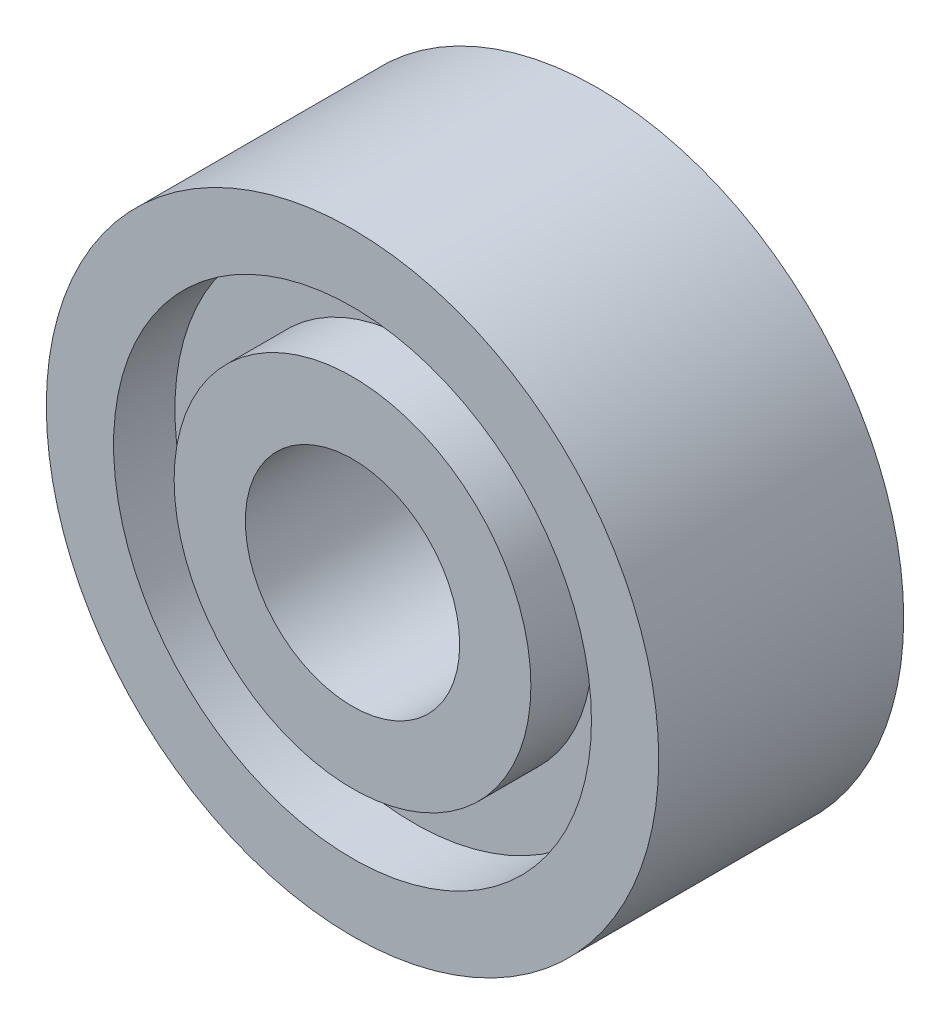
ISO-10303-21;
HEADER;
FILE_DESCRIPTION(('STEP AP214'),'2;1');
FILE_NAME('part.step','',(''),(''),'','','');
FILE_SCHEMA(('AUTOMOTIVE_DESIGN { 1 0 10303 214 1 1 1 1 }'));
ENDSEC;
DATA;
#1=APPLICATION_CONTEXT('core data for automotive mechanical design processes');
#2=APPLICATION_PROTOCOL_DEFINITION('international standard','automotive_design',2000,#1);
#3=PRODUCT_CONTEXT('',#1,'mechanical');
#4=PRODUCT('Part','Part','',(#3));
#5=PRODUCT_RELATED_PRODUCT_CATEGORY('part','',(#4));
#6=PRODUCT_DEFINITION_FORMATION('','',#4);
#7=PRODUCT_DEFINITION_CONTEXT('part definition',#1,'design');
#8=PRODUCT_DEFINITION('design','',#6,#7);
#9=PRODUCT_DEFINITION_SHAPE('','',#8);
#10=(LENGTH_UNIT() NAMED_UNIT(*) SI_UNIT(.MILLI.,.METRE.));
#11=(NAMED_UNIT(*) PLANE_ANGLE_UNIT() SI_UNIT($,.RADIAN.));
#12=(NAMED_UNIT(*) SI_UNIT($,.STERADIAN.) SOLID_ANGLE_UNIT());
#13=UNCERTAINTY_MEASURE_WITH_UNIT(LENGTH_MEASURE(1.E-05),#10,'distance_accuracy_value','');
#14=(GEOMETRIC_REPRESENTATION_CONTEXT(3) GLOBAL_UNCERTAINTY_ASSIGNED_CONTEXT((#13)) GLOBAL_UNIT_ASSIGNED_CONTEXT((#10,
#11,#12)) REPRESENTATION_CONTEXT('',''));
#15=CARTESIAN_POINT('',(0.,0.,0.));
#16=DIRECTION('',(0.,0.,1.));
#17=DIRECTION('',(1.,0.,0.));
#18=AXIS2_PLACEMENT_3D('',#15,#16,#17);
#19=CARTESIAN_POINT('',(0.,7.80314821028766,0.));
#20=DIRECTION('',(0.,0.,-1.));
#21=DIRECTION('',(-1.,0.,0.));
#22=AXIS2_PLACEMENT_3D('',#19,#20,#21);
#23=PLANE('',#22);
#24=CARTESIAN_POINT('',(0.,0.,0.));
#25=DIRECTION('',(0.,0.,1.));
#26=DIRECTION('',(1.,0.,0.));
#27=AXIS2_PLACEMENT_3D('',#24,#25,#26);
#28=CIRCLE('',#27,7.80314821028766);
#29=CARTESIAN_POINT('',(7.80314821028766,0.,0.));
#30=VERTEX_POINT('',#29);
#31=EDGE_CURVE('E88',#30,#30,#28,.T.);
#32=ORIENTED_EDGE('',*,*,#31,.F.);
#33=EDGE_LOOP('',(#32));
#34=FACE_BOUND('',#33,.T.);
#35=CARTESIAN_POINT('',(0.,0.,0.));
#36=DIRECTION('',(0.,0.,1.));
#37=DIRECTION('',(1.,0.,0.));
#38=AXIS2_PLACEMENT_3D('',#35,#36,#37);
#39=CIRCLE('',#38,10.);
#40=CARTESIAN_POINT('',(10.,0.,0.));
#41=VERTEX_POINT('',#40);
#42=EDGE_CURVE('E10',#41,#41,#39,.T.);
#43=ORIENTED_EDGE('',*,*,#42,.T.);
#44=EDGE_LOOP('',(#43));
#45=FACE_BOUND('',#44,.T.);
#46=ADVANCED_FACE('F37',(#34,#45),#23,.F.);
#47=CARTESIAN_POINT('',(0.,0.,23.3142857142857));
#48=DIRECTION('',(0.,0.,1.));
#49=DIRECTION('',(1.,0.,0.));
#50=AXIS2_PLACEMENT_3D('',#47,#48,#49);
#51=CYLINDRICAL_SURFACE('',#50,10.);
#52=ORIENTED_EDGE('',*,*,#42,.F.);
#53=EDGE_LOOP('',(#52));
#54=FACE_BOUND('',#53,.T.);
#55=CARTESIAN_POINT('',(0.,0.,-8.));
#56=DIRECTION('',(0.,0.,1.));
#57=DIRECTION('',(1.,0.,0.));
#58=AXIS2_PLACEMENT_3D('',#55,#56,#57);
#59=CIRCLE('',#58,10.);
#60=CARTESIAN_POINT('',(10.,0.,-8.));
#61=VERTEX_POINT('',#60);
#62=EDGE_CURVE('E44',#61,#61,#59,.T.);
#63=ORIENTED_EDGE('',*,*,#62,.T.);
#64=EDGE_LOOP('',(#63));
#65=FACE_BOUND('',#64,.T.);
#66=ADVANCED_FACE('F96',(#54,#65),#51,.T.);
#67=CARTESIAN_POINT('',(0.,10.,-8.));
#68=DIRECTION('',(0.,0.,1.));
#69=DIRECTION('',(1.,0.,0.));
#70=AXIS2_PLACEMENT_3D('',#67,#68,#69);
#71=PLANE('',#70);
#72=ORIENTED_EDGE('',*,*,#62,.F.);
#73=EDGE_LOOP('',(#72));
#74=FACE_BOUND('',#73,.T.);
#75=CARTESIAN_POINT('',(0.,0.,-8.));
#76=DIRECTION('',(0.,0.,1.));
#77=DIRECTION('',(1.,0.,0.));
#78=AXIS2_PLACEMENT_3D('',#75,#76,#77);
#79=CIRCLE('',#78,7.80314821028767);
#80=CARTESIAN_POINT('',(7.80314821028767,0.,-8.));
#81=VERTEX_POINT('',#80);
#82=EDGE_CURVE('E49',#81,#81,#79,.T.);
#83=ORIENTED_EDGE('',*,*,#82,.T.);
#84=EDGE_LOOP('',(#83));
#85=FACE_BOUND('',#84,.T.);
#86=ADVANCED_FACE('F100',(#74,#85),#71,.F.);
#87=CARTESIAN_POINT('',(0.,0.,23.3142857142857));
#88=DIRECTION('',(0.,0.,1.));
#89=DIRECTION('',(1.,0.,0.));
#90=AXIS2_PLACEMENT_3D('',#87,#88,#89);
#91=CYLINDRICAL_SURFACE('',#90,7.80314821028767);
#92=ORIENTED_EDGE('',*,*,#82,.F.);
#93=EDGE_LOOP('',(#92));
#94=FACE_BOUND('',#93,.T.);
#95=CARTESIAN_POINT('',(0.,0.,-6.43237181267207));
#96=DIRECTION('',(0.,0.,1.));
#97=DIRECTION('',(1.,0.,0.));
#98=AXIS2_PLACEMENT_3D('',#95,#96,#97);
#99=CIRCLE('',#98,7.80314821028767);
#100=CARTESIAN_POINT('',(7.80314821028767,0.,-6.43237181267207));
#101=VERTEX_POINT('',#100);
#102=EDGE_CURVE('E54',#101,#101,#99,.T.);
#103=ORIENTED_EDGE('',*,*,#102,.T.);
#104=EDGE_LOOP('',(#103));
#105=FACE_BOUND('',#104,.T.);
#106=ADVANCED_FACE('F105',(#94,#105),#91,.F.);
#107=CARTESIAN_POINT('',(0.,7.80314821028767,-6.43237181267207));
#108=DIRECTION('',(0.,0.,1.));
#109=DIRECTION('',(1.,0.,0.));
#110=AXIS2_PLACEMENT_3D('',#107,#108,#109);
#111=PLANE('',#110);
#112=ORIENTED_EDGE('',*,*,#102,.F.);
#113=EDGE_LOOP('',(#112));
#114=FACE_BOUND('',#113,.T.);
#115=CARTESIAN_POINT('',(0.,0.,-6.43237181267207));
#116=DIRECTION('',(0.,0.,1.));
#117=DIRECTION('',(1.,0.,0.));
#118=AXIS2_PLACEMENT_3D('',#115,#116,#117);
#119=CIRCLE('',#118,5.82541417828377);
#120=CARTESIAN_POINT('',(5.82541417828377,0.,-6.43237181267207));
#121=VERTEX_POINT('',#120);
#122=EDGE_CURVE('E60',#121,#121,#119,.T.);
#123=ORIENTED_EDGE('',*,*,#122,.T.);
#124=EDGE_LOOP('',(#123));
#125=FACE_BOUND('',#124,.T.);
#126=ADVANCED_FACE('F111',(#114,#125),#111,.F.);
#127=CARTESIAN_POINT('',(0.,0.,23.3142857142857));
#128=DIRECTION('',(0.,0.,1.));
#129=DIRECTION('',(1.,0.,0.));
#130=AXIS2_PLACEMENT_3D('',#127,#128,#129);
#131=CYLINDRICAL_SURFACE('',#130,5.82541417828377);
#132=ORIENTED_EDGE('',*,*,#122,.F.);
#133=EDGE_LOOP('',(#132));
#134=FACE_BOUND('',#133,.T.);
#135=CARTESIAN_POINT('',(0.,0.,-8.));
#136=DIRECTION('',(0.,0.,1.));
#137=DIRECTION('',(1.,0.,0.));
#138=AXIS2_PLACEMENT_3D('',#135,#136,#137);
#139=CIRCLE('',#138,5.82541417828377);
#140=CARTESIAN_POINT('',(5.82541417828377,0.,-8.));
#141=VERTEX_POINT('',#140);
#142=EDGE_CURVE('E64',#141,#141,#139,.T.);
#143=ORIENTED_EDGE('',*,*,#142,.T.);
#144=EDGE_LOOP('',(#143));
#145=FACE_BOUND('',#144,.T.);
#146=ADVANCED_FACE('F115',(#134,#145),#131,.T.);
#147=CARTESIAN_POINT('',(0.,5.82541417828377,-8.));
#148=DIRECTION('',(0.,0.,1.));
#149=DIRECTION('',(1.,0.,0.));
#150=AXIS2_PLACEMENT_3D('',#147,#148,#149);
#151=PLANE('',#150);
#152=ORIENTED_EDGE('',*,*,#142,.F.);
#153=EDGE_LOOP('',(#152));
#154=FACE_BOUND('',#153,.T.);
#155=CARTESIAN_POINT('',(0.,0.,-8.));
#156=DIRECTION('',(0.,0.,1.));
#157=DIRECTION('',(1.,0.,0.));
#158=AXIS2_PLACEMENT_3D('',#155,#156,#157);
#159=CIRCLE('',#158,3.5);
#160=CARTESIAN_POINT('',(3.5,0.,-8.));
#161=VERTEX_POINT('',#160);
#162=EDGE_CURVE('E68',#161,#161,#159,.T.);
#163=ORIENTED_EDGE('',*,*,#162,.T.);
#164=EDGE_LOOP('',(#163));
#165=FACE_BOUND('',#164,.T.);
#166=ADVANCED_FACE('F119',(#154,#165),#151,.F.);
#167=CARTESIAN_POINT('',(0.,0.,23.3142857142857));
#168=DIRECTION('',(0.,0.,1.));
#169=DIRECTION('',(1.,0.,0.));
#170=AXIS2_PLACEMENT_3D('',#167,#168,#169);
#171=CYLINDRICAL_SURFACE('',#170,3.5);
#172=ORIENTED_EDGE('',*,*,#162,.F.);
#173=EDGE_LOOP('',(#172));
#174=FACE_BOUND('',#173,.T.);
#175=CARTESIAN_POINT('',(0.,0.,0.));
#176=DIRECTION('',(0.,0.,1.));
#177=DIRECTION('',(1.,0.,0.));
#178=AXIS2_PLACEMENT_3D('',#175,#176,#177);
#179=CIRCLE('',#178,3.5);
#180=CARTESIAN_POINT('',(3.5,0.,0.));
#181=VERTEX_POINT('',#180);
#182=EDGE_CURVE('E72',#181,#181,#179,.T.);
#183=ORIENTED_EDGE('',*,*,#182,.T.);
#184=EDGE_LOOP('',(#183));
#185=FACE_BOUND('',#184,.T.);
#186=ADVANCED_FACE('F123',(#174,#185),#171,.F.);
#187=CARTESIAN_POINT('',(0.,3.5,0.));
#188=DIRECTION('',(0.,0.,-1.));
#189=DIRECTION('',(-1.,0.,0.));
#190=AXIS2_PLACEMENT_3D('',#187,#188,#189);
#191=PLANE('',#190);
#192=ORIENTED_EDGE('',*,*,#182,.F.);
#193=EDGE_LOOP('',(#192));
#194=FACE_BOUND('',#193,.T.);
#195=CARTESIAN_POINT('',(0.,0.,0.));
#196=DIRECTION('',(0.,0.,1.));
#197=DIRECTION('',(1.,0.,0.));
#198=AXIS2_PLACEMENT_3D('',#195,#196,#197);
#199=CIRCLE('',#198,5.82541417828377);
#200=CARTESIAN_POINT('',(5.82541417828377,0.,0.));
#201=VERTEX_POINT('',#200);
#202=EDGE_CURVE('E76',#201,#201,#199,.T.);
#203=ORIENTED_EDGE('',*,*,#202,.T.);
#204=EDGE_LOOP('',(#203));
#205=FACE_BOUND('',#204,.T.);
#206=ADVANCED_FACE('F127',(#194,#205),#191,.F.);
#207=CARTESIAN_POINT('',(0.,0.,23.3142857142857));
#208=DIRECTION('',(0.,0.,1.));
#209=DIRECTION('',(1.,0.,0.));
#210=AXIS2_PLACEMENT_3D('',#207,#208,#209);
#211=CYLINDRICAL_SURFACE('',#210,5.82541417828377);
#212=ORIENTED_EDGE('',*,*,#202,.F.);
#213=EDGE_LOOP('',(#212));
#214=FACE_BOUND('',#213,.T.);
#215=CARTESIAN_POINT('',(0.,0.,-2.00224758098337));
#216=DIRECTION('',(0.,0.,1.));
#217=DIRECTION('',(1.,0.,0.));
#218=AXIS2_PLACEMENT_3D('',#215,#216,#217);
#219=CIRCLE('',#218,5.82541417828377);
#220=CARTESIAN_POINT('',(5.82541417828377,0.,-2.00224758098337));
#221=VERTEX_POINT('',#220);
#222=EDGE_CURVE('E80',#221,#221,#219,.T.);
#223=ORIENTED_EDGE('',*,*,#222,.T.);
#224=EDGE_LOOP('',(#223));
#225=FACE_BOUND('',#224,.T.);
#226=ADVANCED_FACE('F131',(#214,#225),#211,.T.);
#227=CARTESIAN_POINT('',(0.,5.82541417828377,-2.00224758098337));
#228=DIRECTION('',(0.,0.,-1.));
#229=DIRECTION('',(-1.,0.,0.));
#230=AXIS2_PLACEMENT_3D('',#227,#228,#229);
#231=PLANE('',#230);
#232=ORIENTED_EDGE('',*,*,#222,.F.);
#233=EDGE_LOOP('',(#232));
#234=FACE_BOUND('',#233,.T.);
#235=CARTESIAN_POINT('',(0.,0.,-2.00224758098337));
#236=DIRECTION('',(0.,0.,1.));
#237=DIRECTION('',(1.,0.,0.));
#238=AXIS2_PLACEMENT_3D('',#235,#236,#237);
#239=CIRCLE('',#238,7.80314821028766);
#240=CARTESIAN_POINT('',(7.80314821028766,0.,-2.00224758098337));
#241=VERTEX_POINT('',#240);
#242=EDGE_CURVE('E84',#241,#241,#239,.T.);
#243=ORIENTED_EDGE('',*,*,#242,.T.);
#244=EDGE_LOOP('',(#243));
#245=FACE_BOUND('',#244,.T.);
#246=ADVANCED_FACE('F135',(#234,#245),#231,.F.);
#247=CARTESIAN_POINT('',(0.,0.,23.3142857142857));
#248=DIRECTION('',(0.,0.,1.));
#249=DIRECTION('',(1.,0.,0.));
#250=AXIS2_PLACEMENT_3D('',#247,#248,#249);
#251=CYLINDRICAL_SURFACE('',#250,7.80314821028766);
#252=ORIENTED_EDGE('',*,*,#242,.F.);
#253=EDGE_LOOP('',(#252));
#254=FACE_BOUND('',#253,.T.);
#255=ORIENTED_EDGE('',*,*,#31,.T.);
#256=EDGE_LOOP('',(#255));
#257=FACE_BOUND('',#256,.T.);
#258=ADVANCED_FACE('F93',(#254,#257),#251,.F.);
#259=CLOSED_SHELL('',(#46,#66,#86,#106,#126,#146,#166,#186,#206,#226,#246,#258));
#260=MANIFOLD_SOLID_BREP('B2',#259);
#261=ADVANCED_BREP_SHAPE_REPRESENTATION('',(#18,#260),#14);
#262=SHAPE_DEFINITION_REPRESENTATION(#9,#261);
ENDSEC;
END-ISO-10303-21;
